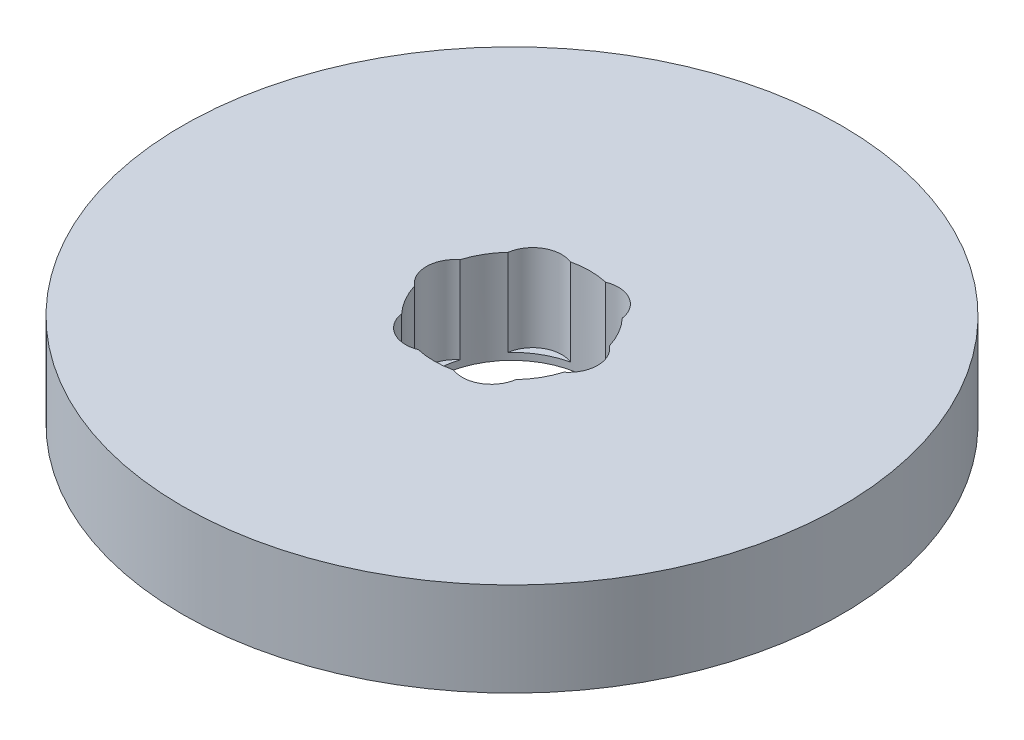
ISO-10303-21;
HEADER;
FILE_DESCRIPTION(('STEP AP214'),'2;1');
FILE_NAME('part.step','',(''),(''),'','','');
FILE_SCHEMA(('AUTOMOTIVE_DESIGN { 1 0 10303 214 1 1 1 1 }'));
ENDSEC;
DATA;
#1=APPLICATION_CONTEXT('core data for automotive mechanical design processes');
#2=APPLICATION_PROTOCOL_DEFINITION('international standard','automotive_design',2000,#1);
#3=PRODUCT_CONTEXT('',#1,'mechanical');
#4=PRODUCT('Part','Part','',(#3));
#5=PRODUCT_RELATED_PRODUCT_CATEGORY('part','',(#4));
#6=PRODUCT_DEFINITION_FORMATION('','',#4);
#7=PRODUCT_DEFINITION_CONTEXT('part definition',#1,'design');
#8=PRODUCT_DEFINITION('design','',#6,#7);
#9=PRODUCT_DEFINITION_SHAPE('','',#8);
#10=(LENGTH_UNIT() NAMED_UNIT(*) SI_UNIT(.MILLI.,.METRE.));
#11=(NAMED_UNIT(*) PLANE_ANGLE_UNIT() SI_UNIT($,.RADIAN.));
#12=(NAMED_UNIT(*) SI_UNIT($,.STERADIAN.) SOLID_ANGLE_UNIT());
#13=UNCERTAINTY_MEASURE_WITH_UNIT(LENGTH_MEASURE(1.E-05),#10,'distance_accuracy_value','');
#14=(GEOMETRIC_REPRESENTATION_CONTEXT(3) GLOBAL_UNCERTAINTY_ASSIGNED_CONTEXT((#13)) GLOBAL_UNIT_ASSIGNED_CONTEXT((#10,
#11,#12)) REPRESENTATION_CONTEXT('',''));
#15=CARTESIAN_POINT('',(0.,0.,0.));
#16=DIRECTION('',(0.,0.,1.));
#17=DIRECTION('',(1.,0.,0.));
#18=AXIS2_PLACEMENT_3D('',#15,#16,#17);
#19=CARTESIAN_POINT('',(0.,27.,0.));
#20=DIRECTION('',(0.,-1.,0.));
#21=DIRECTION('',(0.,0.,-1.));
#22=AXIS2_PLACEMENT_3D('',#19,#20,#21);
#23=CYLINDRICAL_SURFACE('',#22,95.);
#24=CARTESIAN_POINT('',(0.,27.,0.));
#25=DIRECTION('',(0.,1.,0.));
#26=DIRECTION('',(0.,0.,1.));
#27=AXIS2_PLACEMENT_3D('',#24,#25,#26);
#28=CIRCLE('',#27,95.);
#29=CARTESIAN_POINT('',(0.,27.,95.));
#30=VERTEX_POINT('',#29);
#31=EDGE_CURVE('E213',#30,#30,#28,.T.);
#32=ORIENTED_EDGE('',*,*,#31,.F.);
#33=EDGE_LOOP('',(#32));
#34=FACE_BOUND('',#33,.T.);
#35=CARTESIAN_POINT('',(0.,0.,0.));
#36=DIRECTION('',(0.,1.,0.));
#37=DIRECTION('',(0.,0.,1.));
#38=AXIS2_PLACEMENT_3D('',#35,#36,#37);
#39=CIRCLE('',#38,95.);
#40=CARTESIAN_POINT('',(0.,0.,95.));
#41=VERTEX_POINT('',#40);
#42=EDGE_CURVE('E208',#41,#41,#39,.T.);
#43=ORIENTED_EDGE('',*,*,#42,.T.);
#44=EDGE_LOOP('',(#43));
#45=FACE_BOUND('',#44,.T.);
#46=ADVANCED_FACE('F39',(#34,#45),#23,.T.);
#47=CARTESIAN_POINT('',(0.,27.,0.));
#48=DIRECTION('',(0.,1.,0.));
#49=DIRECTION('',(0.,0.,1.));
#50=AXIS2_PLACEMENT_3D('',#47,#48,#49);
#51=PLANE('',#50);
#52=CARTESIAN_POINT('',(-8.15454758024789,27.,14.1240907217273));
#53=DIRECTION('',(0.,1.,0.));
#54=DIRECTION('',(0.86602540378444,0.,0.499999999999998));
#55=AXIS2_PLACEMENT_3D('',#52,#53,#54);
#56=CIRCLE('',#55,8.38681815228938);
#57=CARTESIAN_POINT('',(-16.4513847315251,27.,15.3493302920793));
#58=VERTEX_POINT('',#57);
#59=CARTESIAN_POINT('',(-5.06721759825598,27.,21.9219822509719));
#60=VERTEX_POINT('',#59);
#61=EDGE_CURVE('E198',#58,#60,#56,.T.);
#62=ORIENTED_EDGE('',*,*,#61,.F.);
#63=CARTESIAN_POINT('',(0.,27.,0.));
#64=DIRECTION('',(0.,1.,0.));
#65=DIRECTION('',(0.,0.,1.));
#66=AXIS2_PLACEMENT_3D('',#63,#64,#65);
#67=CIRCLE('',#66,22.5);
#68=CARTESIAN_POINT('',(-21.5186023297812,27.,6.57265195889263));
#69=VERTEX_POINT('',#68);
#70=EDGE_CURVE('E202',#69,#58,#67,.T.);
#71=ORIENTED_EDGE('',*,*,#70,.F.);
#72=CARTESIAN_POINT('',(-16.3090951604958,27.,0.));
#73=DIRECTION('',(0.,1.,0.));
#74=DIRECTION('',(0.,0.,1.));
#75=AXIS2_PLACEMENT_3D('',#72,#73,#74);
#76=CIRCLE('',#75,8.38681815228938);
#77=CARTESIAN_POINT('',(-21.5186023297812,27.,-6.57265195889263));
#78=VERTEX_POINT('',#77);
#79=EDGE_CURVE('E200',#78,#69,#76,.T.);
#80=ORIENTED_EDGE('',*,*,#79,.F.);
#81=CARTESIAN_POINT('',(-16.4513847315254,27.,-15.349330292079));
#82=VERTEX_POINT('',#81);
#83=EDGE_CURVE('E209',#82,#78,#67,.T.);
#84=ORIENTED_EDGE('',*,*,#83,.F.);
#85=CARTESIAN_POINT('',(-8.15454758024809,27.,-14.1240907217272));
#86=DIRECTION('',(0.,1.,0.));
#87=DIRECTION('',(-0.866025403784433,0.,0.50000000000001));
#88=AXIS2_PLACEMENT_3D('',#85,#86,#87);
#89=CIRCLE('',#88,8.38681815228938);
#90=CARTESIAN_POINT('',(-5.06721759825629,27.,-21.9219822509718));
#91=VERTEX_POINT('',#90);
#92=EDGE_CURVE('E58',#91,#82,#89,.T.);
#93=ORIENTED_EDGE('',*,*,#92,.F.);
#94=CARTESIAN_POINT('',(5.06721759825583,27.,-21.9219822509719));
#95=VERTEX_POINT('',#94);
#96=EDGE_CURVE('E148',#95,#91,#67,.T.);
#97=ORIENTED_EDGE('',*,*,#96,.F.);
#98=CARTESIAN_POINT('',(8.15454758024779,27.,-14.1240907217273));
#99=DIRECTION('',(0.,1.,0.));
#100=DIRECTION('',(-0.866025403784443,0.,-0.499999999999992));
#101=AXIS2_PLACEMENT_3D('',#98,#99,#100);
#102=CIRCLE('',#101,8.38681815228938);
#103=CARTESIAN_POINT('',(16.451384731525,27.,-15.3493302920794));
#104=VERTEX_POINT('',#103);
#105=EDGE_CURVE('E137',#104,#95,#102,.T.);
#106=ORIENTED_EDGE('',*,*,#105,.F.);
#107=CARTESIAN_POINT('',(21.5186023297812,27.,-6.57265195889263));
#108=VERTEX_POINT('',#107);
#109=EDGE_CURVE('E446',#108,#104,#67,.T.);
#110=ORIENTED_EDGE('',*,*,#109,.F.);
#111=CARTESIAN_POINT('',(16.3090951604958,27.,0.));
#112=DIRECTION('',(0.,1.,0.));
#113=DIRECTION('',(0.,0.,-1.));
#114=AXIS2_PLACEMENT_3D('',#111,#112,#113);
#115=CIRCLE('',#114,8.38681815228938);
#116=CARTESIAN_POINT('',(21.5186023297812,27.,6.57265195889262));
#117=VERTEX_POINT('',#116);
#118=EDGE_CURVE('E181',#117,#108,#115,.T.);
#119=ORIENTED_EDGE('',*,*,#118,.F.);
#120=CARTESIAN_POINT('',(16.4513847315252,27.,15.3493302920791));
#121=VERTEX_POINT('',#120);
#122=EDGE_CURVE('E441',#121,#117,#67,.T.);
#123=ORIENTED_EDGE('',*,*,#122,.F.);
#124=CARTESIAN_POINT('',(8.15454758024799,27.,14.1240907217272));
#125=DIRECTION('',(0.,1.,0.));
#126=DIRECTION('',(0.866025403784436,0.,-0.500000000000004));
#127=AXIS2_PLACEMENT_3D('',#124,#125,#126);
#128=CIRCLE('',#127,8.38681815228938);
#129=CARTESIAN_POINT('',(5.06721759825614,27.,21.9219822509718));
#130=VERTEX_POINT('',#129);
#131=EDGE_CURVE('E191',#130,#121,#128,.T.);
#132=ORIENTED_EDGE('',*,*,#131,.F.);
#133=EDGE_CURVE('E207',#60,#130,#67,.T.);
#134=ORIENTED_EDGE('',*,*,#133,.F.);
#135=EDGE_LOOP('',(#62,#71,#80,#84,#93,#97,#106,#110,#119,#123,#132,#134));
#136=FACE_BOUND('',#135,.T.);
#137=ORIENTED_EDGE('',*,*,#31,.T.);
#138=EDGE_LOOP('',(#137));
#139=FACE_BOUND('',#138,.T.);
#140=ADVANCED_FACE('F237',(#136,#139),#51,.T.);
#141=CARTESIAN_POINT('',(0.,0.,0.));
#142=DIRECTION('',(0.,1.,0.));
#143=DIRECTION('',(0.,0.,1.));
#144=AXIS2_PLACEMENT_3D('',#141,#142,#143);
#145=PLANE('',#144);
#146=CARTESIAN_POINT('',(0.,0.,0.));
#147=DIRECTION('',(0.,1.,0.));
#148=DIRECTION('',(0.,0.,1.));
#149=AXIS2_PLACEMENT_3D('',#146,#147,#148);
#150=CIRCLE('',#149,22.5);
#151=CARTESIAN_POINT('',(0.,0.,22.5));
#152=VERTEX_POINT('',#151);
#153=EDGE_CURVE('E201',#152,#152,#150,.T.);
#154=ORIENTED_EDGE('',*,*,#153,.T.);
#155=EDGE_LOOP('',(#154));
#156=FACE_BOUND('',#155,.T.);
#157=ORIENTED_EDGE('',*,*,#42,.F.);
#158=EDGE_LOOP('',(#157));
#159=FACE_BOUND('',#158,.T.);
#160=ADVANCED_FACE('F258',(#156,#159),#145,.F.);
#161=CARTESIAN_POINT('',(0.,27.,0.));
#162=DIRECTION('',(0.,-1.,0.));
#163=DIRECTION('',(0.,0.,-1.));
#164=AXIS2_PLACEMENT_3D('',#161,#162,#163);
#165=CYLINDRICAL_SURFACE('',#164,22.5);
#166=DIRECTION('',(0.,1.,0.));
#167=VECTOR('',#166,1.);
#168=CARTESIAN_POINT('',(-16.4513847315251,14.5026655197707,15.3493302920793));
#169=LINE('',#168,#167);
#170=CARTESIAN_POINT('',(-16.4513847315251,2.00533103954133,15.3493302920793));
#171=VERTEX_POINT('',#170);
#172=EDGE_CURVE('E11',#171,#58,#169,.T.);
#173=ORIENTED_EDGE('',*,*,#172,.F.);
#174=CARTESIAN_POINT('',(0.,2.00533103954133,0.));
#175=DIRECTION('',(0.,1.,0.));
#176=DIRECTION('',(0.,0.,1.));
#177=AXIS2_PLACEMENT_3D('',#174,#175,#176);
#178=CIRCLE('',#177,22.5);
#179=CARTESIAN_POINT('',(-5.06721759825598,2.00533103954133,21.9219822509719));
#180=VERTEX_POINT('',#179);
#181=EDGE_CURVE('E134',#171,#180,#178,.T.);
#182=ORIENTED_EDGE('',*,*,#181,.T.);
#183=DIRECTION('',(0.,1.,0.));
#184=VECTOR('',#183,1.);
#185=CARTESIAN_POINT('',(-5.06721759825599,14.5026655197707,21.9219822509719));
#186=LINE('',#185,#184);
#187=EDGE_CURVE('E46',#60,#180,#186,.F.);
#188=ORIENTED_EDGE('',*,*,#187,.F.);
#189=ORIENTED_EDGE('',*,*,#133,.T.);
#190=DIRECTION('',(0.,1.,0.));
#191=VECTOR('',#190,1.);
#192=CARTESIAN_POINT('',(5.06721759825613,14.5026655197707,21.9219822509718));
#193=LINE('',#192,#191);
#194=CARTESIAN_POINT('',(5.06721759825614,2.00533103954133,21.9219822509718));
#195=VERTEX_POINT('',#194);
#196=EDGE_CURVE('E165',#195,#130,#193,.T.);
#197=ORIENTED_EDGE('',*,*,#196,.F.);
#198=CARTESIAN_POINT('',(16.4513847315252,2.00533103954133,15.3493302920791));
#199=VERTEX_POINT('',#198);
#200=EDGE_CURVE('E161',#195,#199,#178,.T.);
#201=ORIENTED_EDGE('',*,*,#200,.T.);
#202=DIRECTION('',(0.,1.,0.));
#203=VECTOR('',#202,1.);
#204=CARTESIAN_POINT('',(16.4513847315252,14.5026655197707,15.3493302920791));
#205=LINE('',#204,#203);
#206=EDGE_CURVE('E157',#121,#199,#205,.F.);
#207=ORIENTED_EDGE('',*,*,#206,.F.);
#208=ORIENTED_EDGE('',*,*,#122,.T.);
#209=DIRECTION('',(0.,1.,0.));
#210=VECTOR('',#209,1.);
#211=CARTESIAN_POINT('',(21.5186023297812,14.5026655197707,6.57265195889263));
#212=LINE('',#211,#210);
#213=CARTESIAN_POINT('',(21.5186023297812,2.00533103954133,6.57265195889262));
#214=VERTEX_POINT('',#213);
#215=EDGE_CURVE('E160',#214,#117,#212,.T.);
#216=ORIENTED_EDGE('',*,*,#215,.F.);
#217=CARTESIAN_POINT('',(21.5186023297812,2.00533103954133,-6.57265195889263));
#218=VERTEX_POINT('',#217);
#219=EDGE_CURVE('E156',#214,#218,#178,.T.);
#220=ORIENTED_EDGE('',*,*,#219,.T.);
#221=DIRECTION('',(0.,1.,0.));
#222=VECTOR('',#221,1.);
#223=CARTESIAN_POINT('',(21.5186023297812,14.5026655197707,-6.57265195889263));
#224=LINE('',#223,#222);
#225=EDGE_CURVE('E152',#108,#218,#224,.F.);
#226=ORIENTED_EDGE('',*,*,#225,.F.);
#227=ORIENTED_EDGE('',*,*,#109,.T.);
#228=DIRECTION('',(0.,1.,0.));
#229=VECTOR('',#228,1.);
#230=CARTESIAN_POINT('',(16.451384731525,14.5026655197707,-15.3493302920794));
#231=LINE('',#230,#229);
#232=CARTESIAN_POINT('',(16.451384731525,2.00533103954133,-15.3493302920794));
#233=VERTEX_POINT('',#232);
#234=EDGE_CURVE('E155',#233,#104,#231,.T.);
#235=ORIENTED_EDGE('',*,*,#234,.F.);
#236=CARTESIAN_POINT('',(5.06721759825583,2.00533103954133,-21.9219822509719));
#237=VERTEX_POINT('',#236);
#238=EDGE_CURVE('E136',#233,#237,#178,.T.);
#239=ORIENTED_EDGE('',*,*,#238,.T.);
#240=DIRECTION('',(0.,1.,0.));
#241=VECTOR('',#240,1.);
#242=CARTESIAN_POINT('',(5.06721759825583,14.5026655197707,-21.9219822509719));
#243=LINE('',#242,#241);
#244=EDGE_CURVE('E150',#95,#237,#243,.F.);
#245=ORIENTED_EDGE('',*,*,#244,.F.);
#246=ORIENTED_EDGE('',*,*,#96,.T.);
#247=DIRECTION('',(0.,1.,0.));
#248=VECTOR('',#247,1.);
#249=CARTESIAN_POINT('',(-5.06721759825629,14.5026655197707,-21.9219822509718));
#250=LINE('',#249,#248);
#251=CARTESIAN_POINT('',(-5.06721759825629,2.00533103954133,-21.9219822509718));
#252=VERTEX_POINT('',#251);
#253=EDGE_CURVE('E135',#252,#91,#250,.T.);
#254=ORIENTED_EDGE('',*,*,#253,.F.);
#255=CARTESIAN_POINT('',(-16.4513847315253,2.00533103954133,-15.349330292079));
#256=VERTEX_POINT('',#255);
#257=EDGE_CURVE('E127',#252,#256,#178,.T.);
#258=ORIENTED_EDGE('',*,*,#257,.T.);
#259=DIRECTION('',(0.,1.,0.));
#260=VECTOR('',#259,1.);
#261=CARTESIAN_POINT('',(-16.4513847315253,14.5026655197707,-15.349330292079));
#262=LINE('',#261,#260);
#263=EDGE_CURVE('E132',#82,#256,#262,.F.);
#264=ORIENTED_EDGE('',*,*,#263,.F.);
#265=ORIENTED_EDGE('',*,*,#83,.T.);
#266=DIRECTION('',(0.,1.,0.));
#267=VECTOR('',#266,1.);
#268=CARTESIAN_POINT('',(-21.5186023297812,14.5026655197707,-6.57265195889263));
#269=LINE('',#268,#267);
#270=CARTESIAN_POINT('',(-21.5186023297812,2.00533103954133,-6.57265195889263));
#271=VERTEX_POINT('',#270);
#272=EDGE_CURVE('E221',#271,#78,#269,.T.);
#273=ORIENTED_EDGE('',*,*,#272,.F.);
#274=CARTESIAN_POINT('',(0.,2.00533103954133,0.));
#275=DIRECTION('',(0.,1.,0.));
#276=DIRECTION('',(0.,0.,1.));
#277=AXIS2_PLACEMENT_3D('',#274,#275,#276);
#278=CIRCLE('',#277,22.5);
#279=CARTESIAN_POINT('',(-21.5186023297812,2.00533103954133,6.57265195889263));
#280=VERTEX_POINT('',#279);
#281=EDGE_CURVE('E216',#271,#280,#278,.T.);
#282=ORIENTED_EDGE('',*,*,#281,.T.);
#283=DIRECTION('',(0.,1.,0.));
#284=VECTOR('',#283,1.);
#285=CARTESIAN_POINT('',(-21.5186023297812,14.5026655197707,6.57265195889263));
#286=LINE('',#285,#284);
#287=EDGE_CURVE('E222',#69,#280,#286,.F.);
#288=ORIENTED_EDGE('',*,*,#287,.F.);
#289=ORIENTED_EDGE('',*,*,#70,.T.);
#290=EDGE_LOOP('',(#173,#182,#188,#189,#197,#201,#207,#208,#216,#220,#226,#227,#235,#239,#245,
#246,#254,#258,#264,#265,#273,#282,#288,#289));
#291=FACE_BOUND('',#290,.T.);
#292=ORIENTED_EDGE('',*,*,#153,.F.);
#293=EDGE_LOOP('',(#292));
#294=FACE_BOUND('',#293,.T.);
#295=ADVANCED_FACE('F142',(#291,#294),#165,.F.);
#296=CARTESIAN_POINT('',(-16.3090951604958,2.00533103954133,0.));
#297=DIRECTION('',(0.,1.,0.));
#298=DIRECTION('',(0.,0.,1.));
#299=AXIS2_PLACEMENT_3D('',#296,#297,#298);
#300=CYLINDRICAL_SURFACE('',#299,8.38681815228938);
#301=ORIENTED_EDGE('',*,*,#272,.T.);
#302=ORIENTED_EDGE('',*,*,#79,.T.);
#303=ORIENTED_EDGE('',*,*,#287,.T.);
#304=CARTESIAN_POINT('',(-16.3090951604958,2.00533103954133,0.));
#305=DIRECTION('',(0.,1.,0.));
#306=DIRECTION('',(0.,0.,1.));
#307=AXIS2_PLACEMENT_3D('',#304,#305,#306);
#308=CIRCLE('',#307,8.38681815228938);
#309=EDGE_CURVE('E203',#271,#280,#308,.T.);
#310=ORIENTED_EDGE('',*,*,#309,.F.);
#311=EDGE_LOOP('',(#301,#302,#303,#310));
#312=FACE_BOUND('',#311,.T.);
#313=ADVANCED_FACE('F229',(#312),#300,.F.);
#314=CARTESIAN_POINT('',(-16.3090951604958,2.00533103954133,0.));
#315=DIRECTION('',(0.,1.,0.));
#316=DIRECTION('',(0.,0.,1.));
#317=AXIS2_PLACEMENT_3D('',#314,#315,#316);
#318=PLANE('',#317);
#319=ORIENTED_EDGE('',*,*,#309,.T.);
#320=ORIENTED_EDGE('',*,*,#281,.F.);
#321=EDGE_LOOP('',(#319,#320));
#322=FACE_BOUND('',#321,.T.);
#323=ADVANCED_FACE('F238',(#322),#318,.T.);
#324=CARTESIAN_POINT('',(-8.15454758024809,2.00533103954133,-14.1240907217272));
#325=DIRECTION('',(0.,1.,0.));
#326=DIRECTION('',(0.,0.,1.));
#327=AXIS2_PLACEMENT_3D('',#324,#325,#326);
#328=CYLINDRICAL_SURFACE('',#327,8.38681815228938);
#329=ORIENTED_EDGE('',*,*,#253,.T.);
#330=ORIENTED_EDGE('',*,*,#92,.T.);
#331=ORIENTED_EDGE('',*,*,#263,.T.);
#332=CARTESIAN_POINT('',(-8.15454758024809,2.00533103954133,-14.1240907217272));
#333=DIRECTION('',(0.,1.,0.));
#334=DIRECTION('',(-0.866025403784433,0.,0.50000000000001));
#335=AXIS2_PLACEMENT_3D('',#332,#333,#334);
#336=CIRCLE('',#335,8.38681815228938);
#337=EDGE_CURVE('E129',#252,#256,#336,.T.);
#338=ORIENTED_EDGE('',*,*,#337,.F.);
#339=EDGE_LOOP('',(#329,#330,#331,#338));
#340=FACE_BOUND('',#339,.T.);
#341=ADVANCED_FACE('F140',(#340),#328,.F.);
#342=CARTESIAN_POINT('',(-8.15454758024789,2.00533103954133,14.1240907217273));
#343=DIRECTION('',(0.,1.,0.));
#344=DIRECTION('',(0.86602540378444,0.,0.499999999999998));
#345=AXIS2_PLACEMENT_3D('',#342,#343,#344);
#346=PLANE('',#345);
#347=ORIENTED_EDGE('',*,*,#337,.T.);
#348=ORIENTED_EDGE('',*,*,#257,.F.);
#349=EDGE_LOOP('',(#347,#348));
#350=FACE_BOUND('',#349,.T.);
#351=ADVANCED_FACE('F126',(#350),#346,.T.);
#352=CARTESIAN_POINT('',(8.15454758024779,2.00533103954133,-14.1240907217273));
#353=DIRECTION('',(0.,1.,0.));
#354=DIRECTION('',(0.,0.,1.));
#355=AXIS2_PLACEMENT_3D('',#352,#353,#354);
#356=CYLINDRICAL_SURFACE('',#355,8.38681815228938);
#357=ORIENTED_EDGE('',*,*,#234,.T.);
#358=ORIENTED_EDGE('',*,*,#105,.T.);
#359=ORIENTED_EDGE('',*,*,#244,.T.);
#360=CARTESIAN_POINT('',(8.15454758024779,2.00533103954133,-14.1240907217273));
#361=DIRECTION('',(0.,1.,0.));
#362=DIRECTION('',(-0.866025403784443,0.,-0.499999999999992));
#363=AXIS2_PLACEMENT_3D('',#360,#361,#362);
#364=CIRCLE('',#363,8.38681815228938);
#365=EDGE_CURVE('E178',#233,#237,#364,.T.);
#366=ORIENTED_EDGE('',*,*,#365,.F.);
#367=EDGE_LOOP('',(#357,#358,#359,#366));
#368=FACE_BOUND('',#367,.T.);
#369=ADVANCED_FACE('F182',(#368),#356,.F.);
#370=ORIENTED_EDGE('',*,*,#365,.T.);
#371=ORIENTED_EDGE('',*,*,#238,.F.);
#372=EDGE_LOOP('',(#370,#371));
#373=FACE_BOUND('',#372,.T.);
#374=ADVANCED_FACE('F177',(#373),#346,.T.);
#375=CARTESIAN_POINT('',(16.3090951604958,2.00533103954133,0.));
#376=DIRECTION('',(0.,1.,0.));
#377=DIRECTION('',(0.,0.,1.));
#378=AXIS2_PLACEMENT_3D('',#375,#376,#377);
#379=CYLINDRICAL_SURFACE('',#378,8.38681815228938);
#380=ORIENTED_EDGE('',*,*,#215,.T.);
#381=ORIENTED_EDGE('',*,*,#118,.T.);
#382=ORIENTED_EDGE('',*,*,#225,.T.);
#383=CARTESIAN_POINT('',(16.3090951604958,2.00533103954133,0.));
#384=DIRECTION('',(0.,1.,0.));
#385=DIRECTION('',(0.,0.,-1.));
#386=AXIS2_PLACEMENT_3D('',#383,#384,#385);
#387=CIRCLE('',#386,8.38681815228938);
#388=EDGE_CURVE('E183',#214,#218,#387,.T.);
#389=ORIENTED_EDGE('',*,*,#388,.F.);
#390=EDGE_LOOP('',(#380,#381,#382,#389));
#391=FACE_BOUND('',#390,.T.);
#392=ADVANCED_FACE('F305',(#391),#379,.F.);
#393=ORIENTED_EDGE('',*,*,#388,.T.);
#394=ORIENTED_EDGE('',*,*,#219,.F.);
#395=EDGE_LOOP('',(#393,#394));
#396=FACE_BOUND('',#395,.T.);
#397=ADVANCED_FACE('F302',(#396),#346,.T.);
#398=CARTESIAN_POINT('',(8.15454758024799,2.00533103954133,14.1240907217272));
#399=DIRECTION('',(0.,1.,0.));
#400=DIRECTION('',(0.,0.,1.));
#401=AXIS2_PLACEMENT_3D('',#398,#399,#400);
#402=CYLINDRICAL_SURFACE('',#401,8.38681815228938);
#403=ORIENTED_EDGE('',*,*,#196,.T.);
#404=ORIENTED_EDGE('',*,*,#131,.T.);
#405=ORIENTED_EDGE('',*,*,#206,.T.);
#406=CARTESIAN_POINT('',(8.15454758024799,2.00533103954133,14.1240907217272));
#407=DIRECTION('',(0.,1.,0.));
#408=DIRECTION('',(0.866025403784436,0.,-0.500000000000004));
#409=AXIS2_PLACEMENT_3D('',#406,#407,#408);
#410=CIRCLE('',#409,8.38681815228938);
#411=EDGE_CURVE('E192',#195,#199,#410,.T.);
#412=ORIENTED_EDGE('',*,*,#411,.F.);
#413=EDGE_LOOP('',(#403,#404,#405,#412));
#414=FACE_BOUND('',#413,.T.);
#415=ADVANCED_FACE('F317',(#414),#402,.F.);
#416=ORIENTED_EDGE('',*,*,#411,.T.);
#417=ORIENTED_EDGE('',*,*,#200,.F.);
#418=EDGE_LOOP('',(#416,#417));
#419=FACE_BOUND('',#418,.T.);
#420=ADVANCED_FACE('F321',(#419),#346,.T.);
#421=CARTESIAN_POINT('',(-8.15454758024789,2.00533103954133,14.1240907217273));
#422=DIRECTION('',(0.,1.,0.));
#423=DIRECTION('',(0.,0.,1.));
#424=AXIS2_PLACEMENT_3D('',#421,#422,#423);
#425=CYLINDRICAL_SURFACE('',#424,8.38681815228938);
#426=ORIENTED_EDGE('',*,*,#172,.T.);
#427=ORIENTED_EDGE('',*,*,#61,.T.);
#428=ORIENTED_EDGE('',*,*,#187,.T.);
#429=CARTESIAN_POINT('',(-8.15454758024789,2.00533103954133,14.1240907217273));
#430=DIRECTION('',(0.,1.,0.));
#431=DIRECTION('',(0.86602540378444,0.,0.499999999999998));
#432=AXIS2_PLACEMENT_3D('',#429,#430,#431);
#433=CIRCLE('',#432,8.38681815228938);
#434=EDGE_CURVE('E55',#171,#180,#433,.T.);
#435=ORIENTED_EDGE('',*,*,#434,.F.);
#436=EDGE_LOOP('',(#426,#427,#428,#435));
#437=FACE_BOUND('',#436,.T.);
#438=ADVANCED_FACE('F340',(#437),#425,.F.);
#439=ORIENTED_EDGE('',*,*,#434,.T.);
#440=ORIENTED_EDGE('',*,*,#181,.F.);
#441=EDGE_LOOP('',(#439,#440));
#442=FACE_BOUND('',#441,.T.);
#443=ADVANCED_FACE('F290',(#442),#346,.T.);
#444=CLOSED_SHELL('',(#46,#140,#160,#295,#313,#323,#341,#351,#369,#374,#392,#397,#415,#420,#438,#443));
#445=MANIFOLD_SOLID_BREP('B2',#444);
#446=ADVANCED_BREP_SHAPE_REPRESENTATION('',(#18,#445),#14);
#447=SHAPE_DEFINITION_REPRESENTATION(#9,#446);
ENDSEC;
END-ISO-10303-21;
